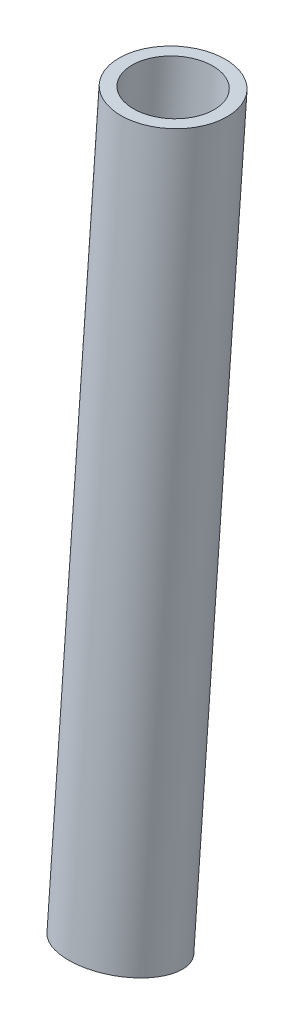
ISO-10303-21;
HEADER;
FILE_DESCRIPTION(('STEP AP214'),'2;1');
FILE_NAME('part.step','',(''),(''),'','','');
FILE_SCHEMA(('AUTOMOTIVE_DESIGN { 1 0 10303 214 1 1 1 1 }'));
ENDSEC;
DATA;
#1=APPLICATION_CONTEXT('core data for automotive mechanical design processes');
#2=APPLICATION_PROTOCOL_DEFINITION('international standard','automotive_design',2000,#1);
#3=PRODUCT_CONTEXT('',#1,'mechanical');
#4=PRODUCT('Part','Part','',(#3));
#5=PRODUCT_RELATED_PRODUCT_CATEGORY('part','',(#4));
#6=PRODUCT_DEFINITION_FORMATION('','',#4);
#7=PRODUCT_DEFINITION_CONTEXT('part definition',#1,'design');
#8=PRODUCT_DEFINITION('design','',#6,#7);
#9=PRODUCT_DEFINITION_SHAPE('','',#8);
#10=(LENGTH_UNIT() NAMED_UNIT(*) SI_UNIT(.MILLI.,.METRE.));
#11=(NAMED_UNIT(*) PLANE_ANGLE_UNIT() SI_UNIT($,.RADIAN.));
#12=(NAMED_UNIT(*) SI_UNIT($,.STERADIAN.) SOLID_ANGLE_UNIT());
#13=UNCERTAINTY_MEASURE_WITH_UNIT(LENGTH_MEASURE(1.E-05),#10,'distance_accuracy_value','');
#14=(GEOMETRIC_REPRESENTATION_CONTEXT(3) GLOBAL_UNCERTAINTY_ASSIGNED_CONTEXT((#13)) GLOBAL_UNIT_ASSIGNED_CONTEXT((#10,
#11,#12)) REPRESENTATION_CONTEXT('',''));
#15=CARTESIAN_POINT('',(0.,0.,0.));
#16=DIRECTION('',(0.,0.,1.));
#17=DIRECTION('',(1.,0.,0.));
#18=AXIS2_PLACEMENT_3D('',#15,#16,#17);
#19=CARTESIAN_POINT('',(899.196916053029,101.086343763392,-238.011921297441));
#20=DIRECTION('',(0.00459360392302388,0.9976356448477,-0.0685712690003063));
#21=DIRECTION('',(0.,0.068571992479684,0.99764617066742));
#22=AXIS2_PLACEMENT_3D('',#19,#20,#21);
#23=CYLINDRICAL_SURFACE('',#22,9.64999999999998);
#24=CARTESIAN_POINT('',(900.,275.499546279119,-249.999999999998));
#25=DIRECTION('',(-0.00229816078025706,-0.999408736415632,0.034305918339809));
#26=DIRECTION('',(0.0668008812398191,-0.0343828093108978,-0.997173738467612));
#27=AXIS2_PLACEMENT_3D('',#24,#25,#26);
#28=ELLIPSE('',#27,9.65570906915421,9.64999999999998);
#29=CARTESIAN_POINT('',(900.645009874815,275.167555875433,-259.628419510043));
#30=VERTEX_POINT('',#29);
#31=EDGE_CURVE('E49',#30,#30,#28,.T.);
#32=ORIENTED_EDGE('',*,*,#31,.F.);
#33=EDGE_LOOP('',(#32));
#34=FACE_BOUND('',#33,.T.);
#35=CARTESIAN_POINT('',(899.196916053029,101.086343763392,-238.011921297441));
#36=DIRECTION('',(0.00143638782424149,-0.977156337317368,0.212516891635755));
#37=DIRECTION('',(0.0414428460712231,0.212392700268517,0.976305193769943));
#38=AXIS2_PLACEMENT_3D('',#35,#36,#37);
#39=ELLIPSE('',#38,9.75326811540499,9.64999999999998);
#40=CARTESIAN_POINT('',(899.601119242227,103.157866714865,-228.48975498014));
#41=VERTEX_POINT('',#40);
#42=EDGE_CURVE('E44',#41,#41,#39,.T.);
#43=ORIENTED_EDGE('',*,*,#42,.T.);
#44=EDGE_LOOP('',(#43));
#45=FACE_BOUND('',#44,.T.);
#46=ADVANCED_FACE('F40',(#34,#45),#23,.F.);
#47=CARTESIAN_POINT('',(899.196916053029,101.086343763392,-238.011921297441));
#48=DIRECTION('',(0.00459360392302388,0.9976356448477,-0.0685712690003063));
#49=DIRECTION('',(0.,0.068571992479684,0.99764617066742));
#50=AXIS2_PLACEMENT_3D('',#47,#48,#49);
#51=CYLINDRICAL_SURFACE('',#50,12.7000000000001);
#52=CARTESIAN_POINT('',(900.,275.499546279119,-249.999999999998));
#53=DIRECTION('',(-0.00229816078025706,-0.999408736415632,0.034305918339809));
#54=DIRECTION('',(0.0668008812398191,-0.0343828093108978,-0.997173738467612));
#55=AXIS2_PLACEMENT_3D('',#52,#53,#54);
#56=ELLIPSE('',#55,12.7075134899751,12.7000000000001);
#57=CARTESIAN_POINT('',(900.848873099497,275.062626265978,-262.671598733424));
#58=VERTEX_POINT('',#57);
#59=EDGE_CURVE('E55',#58,#58,#56,.T.);
#60=ORIENTED_EDGE('',*,*,#59,.T.);
#61=EDGE_LOOP('',(#60));
#62=FACE_BOUND('',#61,.T.);
#63=CARTESIAN_POINT('',(899.196916053029,101.086343763392,-238.011921297441));
#64=DIRECTION('',(0.00143638782424149,-0.977156337317368,0.212516891635755));
#65=DIRECTION('',(0.0414428460712231,0.212392700268517,0.976305193769943));
#66=AXIS2_PLACEMENT_3D('',#63,#64,#65);
#67=ELLIPSE('',#66,12.8359072606885,12.7000000000001);
#68=CARTESIAN_POINT('',(899.728872581818,103.812596766886,-225.480158372081));
#69=VERTEX_POINT('',#68);
#70=EDGE_CURVE('E10',#69,#69,#67,.T.);
#71=ORIENTED_EDGE('',*,*,#70,.F.);
#72=EDGE_LOOP('',(#71));
#73=FACE_BOUND('',#72,.T.);
#74=ADVANCED_FACE('F75',(#62,#73),#51,.T.);
#75=CARTESIAN_POINT('',(899.999999999999,275.499546279119,-249.999999999998));
#76=DIRECTION('',(-0.00229816078025706,-0.999408736415632,0.034305918339809));
#77=DIRECTION('',(0.,-0.0343060089342588,-0.999411375636181));
#78=AXIS2_PLACEMENT_3D('',#75,#76,#77);
#79=PLANE('',#78);
#80=ORIENTED_EDGE('',*,*,#31,.T.);
#81=EDGE_LOOP('',(#80));
#82=FACE_BOUND('',#81,.T.);
#83=ORIENTED_EDGE('',*,*,#59,.F.);
#84=EDGE_LOOP('',(#83));
#85=FACE_BOUND('',#84,.T.);
#86=ADVANCED_FACE('F70',(#82,#85),#79,.F.);
#87=CARTESIAN_POINT('',(899.196916053029,101.086343763392,-238.011921297441));
#88=DIRECTION('',(0.00143638782424149,-0.977156337317368,0.212516891635755));
#89=DIRECTION('',(0.,-0.21251711086958,-0.977157345358283));
#90=AXIS2_PLACEMENT_3D('',#87,#88,#89);
#91=PLANE('',#90);
#92=ORIENTED_EDGE('',*,*,#42,.F.);
#93=EDGE_LOOP('',(#92));
#94=FACE_BOUND('',#93,.T.);
#95=ORIENTED_EDGE('',*,*,#70,.T.);
#96=EDGE_LOOP('',(#95));
#97=FACE_BOUND('',#96,.T.);
#98=ADVANCED_FACE('F42',(#94,#97),#91,.T.);
#99=CLOSED_SHELL('',(#46,#74,#86,#98));
#100=MANIFOLD_SOLID_BREP('B2',#99);
#101=ADVANCED_BREP_SHAPE_REPRESENTATION('',(#18,#100),#14);
#102=SHAPE_DEFINITION_REPRESENTATION(#9,#101);
ENDSEC;
END-ISO-10303-21;
